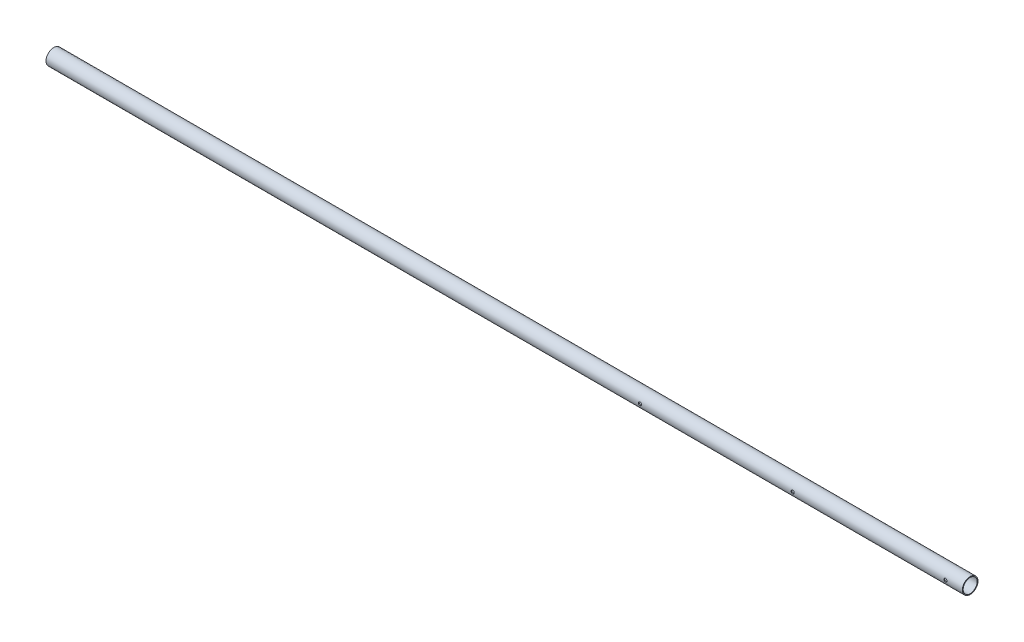
ISO-10303-21;
HEADER;
FILE_DESCRIPTION(('STEP AP214'),'2;1');
FILE_NAME('part.step','',(''),(''),'','','');
FILE_SCHEMA(('AUTOMOTIVE_DESIGN { 1 0 10303 214 1 1 1 1 }'));
ENDSEC;
DATA;
#1=APPLICATION_CONTEXT('core data for automotive mechanical design processes');
#2=APPLICATION_PROTOCOL_DEFINITION('international standard','automotive_design',2000,#1);
#3=PRODUCT_CONTEXT('',#1,'mechanical');
#4=PRODUCT('Part','Part','',(#3));
#5=PRODUCT_RELATED_PRODUCT_CATEGORY('part','',(#4));
#6=PRODUCT_DEFINITION_FORMATION('','',#4);
#7=PRODUCT_DEFINITION_CONTEXT('part definition',#1,'design');
#8=PRODUCT_DEFINITION('design','',#6,#7);
#9=PRODUCT_DEFINITION_SHAPE('','',#8);
#10=(LENGTH_UNIT() NAMED_UNIT(*) SI_UNIT(.MILLI.,.METRE.));
#11=(NAMED_UNIT(*) PLANE_ANGLE_UNIT() SI_UNIT($,.RADIAN.));
#12=(NAMED_UNIT(*) SI_UNIT($,.STERADIAN.) SOLID_ANGLE_UNIT());
#13=UNCERTAINTY_MEASURE_WITH_UNIT(LENGTH_MEASURE(1.E-05),#10,'distance_accuracy_value','');
#14=(GEOMETRIC_REPRESENTATION_CONTEXT(3) GLOBAL_UNCERTAINTY_ASSIGNED_CONTEXT((#13)) GLOBAL_UNIT_ASSIGNED_CONTEXT((#10,
#11,#12)) REPRESENTATION_CONTEXT('',''));
#15=CARTESIAN_POINT('',(0.,0.,0.));
#16=DIRECTION('',(0.,0.,1.));
#17=DIRECTION('',(1.,0.,0.));
#18=AXIS2_PLACEMENT_3D('',#15,#16,#17);
#19=CARTESIAN_POINT('',(1346.2,0.,0.));
#20=DIRECTION('',(0.,0.,1.));
#21=DIRECTION('',(1.,0.,0.));
#22=AXIS2_PLACEMENT_3D('',#19,#20,#21);
#23=CYLINDRICAL_SURFACE('',#22,2.3876);
#24=CARTESIAN_POINT('',(1348.5876,0.,10.4648));
#25=CARTESIAN_POINT('',(1348.58759342942,-0.132130476058958,10.4647964514016));
#26=CARTESIAN_POINT('',(1348.57658382838,-0.26442035829009,10.462269601893));
#27=CARTESIAN_POINT('',(1348.53285409384,-0.525345225066874,10.4524244369325));
#28=CARTESIAN_POINT('',(1348.5000921047,-0.653972663795576,10.4450968843992));
#29=CARTESIAN_POINT('',(1348.41394288479,-0.903596989816673,10.426465897886));
#30=CARTESIAN_POINT('',(1348.36058819743,-1.0246055682684,10.4151687397336));
#31=CARTESIAN_POINT('',(1348.2348585468,-1.25591227924269,10.3898161075362));
#32=CARTESIAN_POINT('',(1348.16248912613,-1.36621352003838,10.3757614375804));
#33=CARTESIAN_POINT('',(1347.99943793492,-1.57495019781505,10.3461524526149));
#34=CARTESIAN_POINT('',(1347.90848664261,-1.67317229092837,10.3305780670015));
#35=CARTESIAN_POINT('',(1347.71142734329,-1.85311314339548,10.2998234611443));
#36=CARTESIAN_POINT('',(1347.60531706909,-1.93482942970319,10.2846433002633));
#37=CARTESIAN_POINT('',(1347.37936947375,-2.08038327019831,10.2561995352339));
#38=CARTESIAN_POINT('',(1347.25938154656,-2.14399244864527,10.2429613530362));
#39=CARTESIAN_POINT('',(1347.01006778758,-2.25005969360349,10.2201875236951));
#40=CARTESIAN_POINT('',(1346.88074325748,-2.29252070204645,10.2106513616026));
#41=CARTESIAN_POINT('',(1346.6187332751,-2.3543805931442,10.1965646284168));
#42=CARTESIAN_POINT('',(1346.48614123018,-2.37415617862409,10.1919327227922));
#43=CARTESIAN_POINT('',(1346.21944657922,-2.39125577964706,10.187934919261));
#44=CARTESIAN_POINT('',(1346.08534417616,-2.38858277701799,10.1885683219677));
#45=CARTESIAN_POINT('',(1345.822261765,-2.36116353389813,10.19495607049));
#46=CARTESIAN_POINT('',(1345.6932329336,-2.33685826485837,10.2006081066181));
#47=CARTESIAN_POINT('',(1345.4411330728,-2.26756413482412,10.2162342190724));
#48=CARTESIAN_POINT('',(1345.31806244654,-2.22257387640582,10.2262085874015));
#49=CARTESIAN_POINT('',(1345.08014690702,-2.11278891738552,10.2494546633016));
#50=CARTESIAN_POINT('',(1344.96538204721,-2.04782683973289,10.262754053739));
#51=CARTESIAN_POINT('',(1344.74822847749,-1.9000645756493,10.2911338885937));
#52=CARTESIAN_POINT('',(1344.64584072971,-1.81726300387498,10.30621447129));
#53=CARTESIAN_POINT('',(1344.45382007371,-1.63386805841729,10.3368922317217));
#54=CARTESIAN_POINT('',(1344.36454200676,-1.53290344594706,10.352493236861));
#55=CARTESIAN_POINT('',(1344.20408669377,-1.31720690355541,10.3821402814243));
#56=CARTESIAN_POINT('',(1344.13291729276,-1.20246903835412,10.3961856454301));
#57=CARTESIAN_POINT('',(1344.01060276489,-0.961997129098335,10.4211927318742));
#58=CARTESIAN_POINT('',(1343.95952331596,-0.836228635777724,10.4321443077834));
#59=CARTESIAN_POINT('',(1343.87942240763,-0.577744190266569,10.4496381198318));
#60=CARTESIAN_POINT('',(1343.85035483603,-0.445043387745706,10.4561895704206));
#61=CARTESIAN_POINT('',(1343.82596205163,-0.259405998113417,10.4617127845025));
#62=CARTESIAN_POINT('',(1343.82088093484,-0.207669475492341,10.4628677610205));
#63=CARTESIAN_POINT('',(1343.81409861297,-0.103963530060327,10.4644120677081));
#64=CARTESIAN_POINT('',(1343.81239741444,-0.0519941067982687,10.464801396394));
#65=CARTESIAN_POINT('',(1343.81240657058,0.132130476058952,10.4647964514016));
#66=CARTESIAN_POINT('',(1343.82341617162,0.264420358290088,10.462269601893));
#67=CARTESIAN_POINT('',(1343.86714590616,0.52534522506687,10.4524244369325));
#68=CARTESIAN_POINT('',(1343.8999078953,0.653972663795564,10.4450968843992));
#69=CARTESIAN_POINT('',(1343.98605711521,0.903596989816605,10.426465897886));
#70=CARTESIAN_POINT('',(1344.03941180257,1.02460556826829,10.4151687397336));
#71=CARTESIAN_POINT('',(1344.1651414532,1.25591227924259,10.3898161075362));
#72=CARTESIAN_POINT('',(1344.23751087387,1.36621352003832,10.3757614375804));
#73=CARTESIAN_POINT('',(1344.40056206508,1.57495019781504,10.3461524526149));
#74=CARTESIAN_POINT('',(1344.49151335739,1.67317229092836,10.3305780670015));
#75=CARTESIAN_POINT('',(1344.68857265671,1.85311314339549,10.2998234611443));
#76=CARTESIAN_POINT('',(1344.79468293091,1.93482942970319,10.2846433002633));
#77=CARTESIAN_POINT('',(1345.02063052625,2.08038327019831,10.2561995352339));
#78=CARTESIAN_POINT('',(1345.14061845344,2.14399244864527,10.2429613530362));
#79=CARTESIAN_POINT('',(1345.38993221242,2.25005969360349,10.2201875236951));
#80=CARTESIAN_POINT('',(1345.51925674251,2.29252070204645,10.2106513616026));
#81=CARTESIAN_POINT('',(1345.7812667249,2.3543805931442,10.1965646284168));
#82=CARTESIAN_POINT('',(1345.91385876982,2.37415617862409,10.1919327227922));
#83=CARTESIAN_POINT('',(1346.18055342078,2.39125577964706,10.187934919261));
#84=CARTESIAN_POINT('',(1346.31465582384,2.38858277701799,10.1885683219677));
#85=CARTESIAN_POINT('',(1346.577738235,2.36116353389813,10.19495607049));
#86=CARTESIAN_POINT('',(1346.7067670664,2.33685826485837,10.2006081066181));
#87=CARTESIAN_POINT('',(1346.9588669272,2.26756413482412,10.2162342190724));
#88=CARTESIAN_POINT('',(1347.08193755346,2.22257387640582,10.2262085874015));
#89=CARTESIAN_POINT('',(1347.31985309298,2.11278891738551,10.2494546633016));
#90=CARTESIAN_POINT('',(1347.43461795279,2.04782683973289,10.262754053739));
#91=CARTESIAN_POINT('',(1347.65177152251,1.9000645756493,10.2911338885937));
#92=CARTESIAN_POINT('',(1347.75415927029,1.81726300387498,10.30621447129));
#93=CARTESIAN_POINT('',(1347.94617992629,1.63386805841729,10.3368922317217));
#94=CARTESIAN_POINT('',(1348.03545799324,1.53290344594706,10.352493236861));
#95=CARTESIAN_POINT('',(1348.19591330623,1.31720690355541,10.3821402814243));
#96=CARTESIAN_POINT('',(1348.26708270724,1.20246903835412,10.3961856454301));
#97=CARTESIAN_POINT('',(1348.38939723511,0.961997129098335,10.4211927318742));
#98=CARTESIAN_POINT('',(1348.44047668404,0.836228635777724,10.4321443077834));
#99=CARTESIAN_POINT('',(1348.52057759237,0.577744190266569,10.4496381198318));
#100=CARTESIAN_POINT('',(1348.54964516397,0.445043387745705,10.4561895704206));
#101=CARTESIAN_POINT('',(1348.57403794837,0.259405998113415,10.4617127845025));
#102=CARTESIAN_POINT('',(1348.57911906516,0.207669475492338,10.4628677610205));
#103=CARTESIAN_POINT('',(1348.58590138703,0.103963530060321,10.4644120677081));
#104=CARTESIAN_POINT('',(1348.58760258556,0.0519941067982618,10.464801396394));
#105=CARTESIAN_POINT('',(1348.5876,0.,10.4648));
#106=B_SPLINE_CURVE_WITH_KNOTS('',3,(#24,#25,#26,#27,#28,#29,#30,#31,#32,#33,#34,#35,#36,#37,
#38,#39,#40,#41,#42,#43,#44,#45,#46,#47,#48,#49,#50,#51,#52,#53,#54,#55,#56,#57,#58,#59,#60,#61,
#62,#63,#64,#65,#66,#67,#68,#69,#70,#71,#72,#73,#74,#75,#76,#77,#78,#79,#80,#81,#82,#83,#84,#85,
#86,#87,#88,#89,#90,#91,#92,#93,#94,#95,#96,#97,#98,#99,#100,#101,#102,#103,#104,#105),
.UNSPECIFIED.,.T.,.F.,(4,2,2,2,2,2,2,2,2,2,2,2,2,2,2,2,2,2,2,2,2,2,2,2,2,2,2,2,2,2,2,2,2,2,2,2,
2,2,2,2,4),(0.,0.396192335565521,0.79314923653144,1.18948136344175,1.58569809138059,
1.98813187019891,2.39062590055581,2.79799171002006,3.20530083479917,3.60574375712302,
4.00613348977787,4.39854363394342,4.79098029220883,5.18679987270531,5.58265020204459,
5.98777052529928,6.39306605720458,6.7996757791592,7.20543132878512,7.36133500297467,
7.51723897927499,7.91343131484052,8.31038821580644,8.7067203427165,9.10293707065561,
9.50537084947393,9.90786487983083,10.3152306892951,10.7225398140742,11.122982736398,
11.5233724690529,11.9157826132184,12.3082192714839,12.7040388519803,13.0998891813196,
13.5050095045743,13.9103050364796,14.3169147584342,14.7226703080601,14.8785739822497,
15.03447795855),.UNSPECIFIED.);
#107=CARTESIAN_POINT('',(1348.5876,0.,10.4648));
#108=VERTEX_POINT('',#107);
#109=EDGE_CURVE('E19',#108,#108,#106,.T.);
#110=ORIENTED_EDGE('',*,*,#109,.T.);
#111=EDGE_LOOP('',(#110));
#112=FACE_BOUND('',#111,.T.);
#113=CARTESIAN_POINT('',(1343.8124,0.,11.7094));
#114=CARTESIAN_POINT('',(1343.81240638749,0.132501086344402,11.7093968551788));
#115=CARTESIAN_POINT('',(1343.82347741642,0.265166024845111,11.7071257374413));
#116=CARTESIAN_POINT('',(1343.86746253428,0.526849554492236,11.6982775922243));
#117=CARTESIAN_POINT('',(1343.90041970649,0.655860429224841,11.6916920721091));
#118=CARTESIAN_POINT('',(1343.98711640493,0.906255046388023,11.6749505775353));
#119=CARTESIAN_POINT('',(1344.04082606826,1.02764945848302,11.6647997354875));
#120=CARTESIAN_POINT('',(1344.16742554739,1.25965911690133,11.6420321579165));
#121=CARTESIAN_POINT('',(1344.24030911711,1.3702778574534,11.6294162257641));
#122=CARTESIAN_POINT('',(1344.40428905761,1.57921276418643,11.6029039480084));
#123=CARTESIAN_POINT('',(1344.49560496124,1.6773548592244,11.5889933768196));
#124=CARTESIAN_POINT('',(1344.69338992463,1.85704483488596,11.5615619569379));
#125=CARTESIAN_POINT('',(1344.79986100551,1.93859049865887,11.5480411605155));
#126=CARTESIAN_POINT('',(1345.02617616915,2.08350496871513,11.5227833227264));
#127=CARTESIAN_POINT('',(1345.14613726705,2.14669446383451,11.5110643719314));
#128=CARTESIAN_POINT('',(1345.39525169725,2.2519530622886,11.4909375714077));
#129=CARTESIAN_POINT('',(1345.52440400429,2.29402451711494,11.4825293530518));
#130=CARTESIAN_POINT('',(1345.78637591486,2.35529135266296,11.4701187577407));
#131=CARTESIAN_POINT('',(1345.91912176044,2.37479005044551,11.466058019604));
#132=CARTESIAN_POINT('',(1346.18605820987,2.39130019113447,11.4626265766828));
#133=CARTESIAN_POINT('',(1346.32024866074,2.38831399216307,11.4632553800786));
#134=CARTESIAN_POINT('',(1346.58403749701,2.36018417024732,11.4690789755403));
#135=CARTESIAN_POINT('',(1346.71367490494,2.33538937330178,11.4742018815859));
#136=CARTESIAN_POINT('',(1346.96691147803,2.26489687388461,11.4883232389105));
#137=CARTESIAN_POINT('',(1347.09051029864,2.21919798021408,11.4973219110444));
#138=CARTESIAN_POINT('',(1347.32916405645,2.10786238672539,11.5182541614116));
#139=CARTESIAN_POINT('',(1347.44415275148,2.04208765068246,11.530207946514));
#140=CARTESIAN_POINT('',(1347.66158281708,1.89256990409025,11.5556895535593));
#141=CARTESIAN_POINT('',(1347.76402360739,1.80882606308652,11.5692174482375));
#142=CARTESIAN_POINT('',(1347.95545409263,1.62390008155478,11.5966321353516));
#143=CARTESIAN_POINT('',(1348.04415921704,1.52242344107398,11.6105209319932));
#144=CARTESIAN_POINT('',(1348.20337284237,1.30583257466412,11.6368694878022));
#145=CARTESIAN_POINT('',(1348.27387336649,1.19071240261345,11.6493286192029));
#146=CARTESIAN_POINT('',(1348.39472850654,0.949748586750855,11.6714479602392));
#147=CARTESIAN_POINT('',(1348.4450333982,0.823879389397865,11.6811012456));
#148=CARTESIAN_POINT('',(1348.52360409381,0.565396223279503,11.6964543805325));
#149=CARTESIAN_POINT('',(1348.55191613784,0.432797033549384,11.7021625219848));
#150=CARTESIAN_POINT('',(1348.57507485099,0.249318904557282,11.7068515544713));
#151=CARTESIAN_POINT('',(1348.57976771513,0.199582540492454,11.7078050643738));
#152=CARTESIAN_POINT('',(1348.58603149622,0.0999052173920099,11.7090798805314));
#153=CARTESIAN_POINT('',(1348.58760240863,0.0499642580588537,11.7094011858669));
#154=CARTESIAN_POINT('',(1348.58759361251,-0.132501086344418,11.7093968551788));
#155=CARTESIAN_POINT('',(1348.57652258358,-0.265166024845124,11.7071257374413));
#156=CARTESIAN_POINT('',(1348.53253746572,-0.526849554492242,11.6982775922243));
#157=CARTESIAN_POINT('',(1348.49958029351,-0.655860429224842,11.6916920721091));
#158=CARTESIAN_POINT('',(1348.41288359507,-0.906255046388021,11.6749505775353));
#159=CARTESIAN_POINT('',(1348.35917393174,-1.02764945848302,11.6647997354875));
#160=CARTESIAN_POINT('',(1348.23257445261,-1.25965911690133,11.6420321579165));
#161=CARTESIAN_POINT('',(1348.15969088289,-1.3702778574534,11.6294162257641));
#162=CARTESIAN_POINT('',(1347.99571094239,-1.57921276418643,11.6029039480084));
#163=CARTESIAN_POINT('',(1347.90439503876,-1.6773548592244,11.5889933768196));
#164=CARTESIAN_POINT('',(1347.70661007537,-1.85704483488596,11.5615619569379));
#165=CARTESIAN_POINT('',(1347.60013899449,-1.93859049865887,11.5480411605155));
#166=CARTESIAN_POINT('',(1347.37382383085,-2.08350496871509,11.5227833227264));
#167=CARTESIAN_POINT('',(1347.25386273295,-2.14669446383445,11.5110643719314));
#168=CARTESIAN_POINT('',(1347.00474830275,-2.25195306228856,11.4909375714077));
#169=CARTESIAN_POINT('',(1346.87559599571,-2.29402451711493,11.4825293530518));
#170=CARTESIAN_POINT('',(1346.61362408514,-2.35529135266296,11.4701187577407));
#171=CARTESIAN_POINT('',(1346.48087823956,-2.37479005044551,11.466058019604));
#172=CARTESIAN_POINT('',(1346.21394179013,-2.39130019113447,11.4626265766828));
#173=CARTESIAN_POINT('',(1346.07975133926,-2.38831399216307,11.4632553800786));
#174=CARTESIAN_POINT('',(1345.81596250299,-2.36018417024732,11.4690789755403));
#175=CARTESIAN_POINT('',(1345.68632509506,-2.33538937330178,11.4742018815859));
#176=CARTESIAN_POINT('',(1345.43308852197,-2.26489687388461,11.4883232389105));
#177=CARTESIAN_POINT('',(1345.30948970136,-2.21919798021407,11.4973219110444));
#178=CARTESIAN_POINT('',(1345.07083594354,-2.10786238672536,11.5182541614117));
#179=CARTESIAN_POINT('',(1344.95584724852,-2.04208765068242,11.530207946514));
#180=CARTESIAN_POINT('',(1344.73841718292,-1.89256990409018,11.5556895535593));
#181=CARTESIAN_POINT('',(1344.63597639261,-1.80882606308647,11.5692174482375));
#182=CARTESIAN_POINT('',(1344.44454590737,-1.6239000815548,11.5966321353516));
#183=CARTESIAN_POINT('',(1344.35584078296,-1.52242344107406,11.6105209319932));
#184=CARTESIAN_POINT('',(1344.19662715763,-1.30583257466421,11.6368694878022));
#185=CARTESIAN_POINT('',(1344.12612663351,-1.19071240261349,11.6493286192029));
#186=CARTESIAN_POINT('',(1344.00527149346,-0.949748586750846,11.6714479602392));
#187=CARTESIAN_POINT('',(1343.9549666018,-0.823879389397863,11.6811012456));
#188=CARTESIAN_POINT('',(1343.87639590619,-0.565396223279506,11.6964543805325));
#189=CARTESIAN_POINT('',(1343.84808386216,-0.432797033549385,11.7021625219848));
#190=CARTESIAN_POINT('',(1343.82492514901,-0.249318904557286,11.7068515544713));
#191=CARTESIAN_POINT('',(1343.82023228487,-0.199582540492461,11.7078050643738));
#192=CARTESIAN_POINT('',(1343.81396850378,-0.0999052173920233,11.7090798805314));
#193=CARTESIAN_POINT('',(1343.81239759137,-0.0499642580588701,11.7094011858669));
#194=CARTESIAN_POINT('',(1343.8124,0.,11.7094));
#195=B_SPLINE_CURVE_WITH_KNOTS('',3,(#113,#114,#115,#116,#117,#118,#119,#120,#121,#122,#123,
#124,#125,#126,#127,#128,#129,#130,#131,#132,#133,#134,#135,#136,#137,#138,#139,#140,#141,#142,
#143,#144,#145,#146,#147,#148,#149,#150,#151,#152,#153,#154,#155,#156,#157,#158,#159,#160,#161,
#162,#163,#164,#165,#166,#167,#168,#169,#170,#171,#172,#173,#174,#175,#176,#177,#178,#179,#180,
#181,#182,#183,#184,#185,#186,#187,#188,#189,#190,#191,#192,#193,#194),.UNSPECIFIED.,.T.,.F.,(4,
2,2,2,2,2,2,2,2,2,2,2,2,2,2,2,2,2,2,2,2,2,2,2,2,2,2,2,2,2,2,2,2,2,2,2,2,2,2,2,4),(0.,
0.397312200182848,0.795408844407309,1.19293474701021,1.59033131169665,1.99277446437493,
2.39527133774065,2.80157706515167,3.20783754041949,3.60857317253208,4.00926677774833,
4.40366556094125,4.79808682135193,5.19528356005151,5.5924986594244,5.99707755264027,
6.40183342228438,6.80757983006336,7.21247082756086,7.36229133822712,7.51211206685327,
7.90942426703611,8.30752091126056,8.70504681386346,9.1024433785499,9.50488653122819,
9.9073834045939,10.3136891320047,10.7199496072727,11.1206852393853,11.5213788446016,
11.9157776277945,12.3101988882052,12.707395626905,13.1046107262777,13.5091896194935,
13.9139454891377,14.3196918969166,14.7245828944141,14.8744034050804,15.0242241337065),.UNSPECIFIED.);
#196=CARTESIAN_POINT('',(1343.8124,0.,11.7094));
#197=VERTEX_POINT('',#196);
#198=EDGE_CURVE('E58',#197,#197,#195,.T.);
#199=ORIENTED_EDGE('',*,*,#198,.F.);
#200=EDGE_LOOP('',(#199));
#201=FACE_BOUND('',#200,.T.);
#202=ADVANCED_FACE('F15',(#112,#201),#23,.F.);
#203=CARTESIAN_POINT('',(1117.6,0.,0.));
#204=DIRECTION('',(0.,0.,1.));
#205=DIRECTION('',(1.,0.,0.));
#206=AXIS2_PLACEMENT_3D('',#203,#204,#205);
#207=CYLINDRICAL_SURFACE('',#206,2.3876);
#208=CARTESIAN_POINT('',(1119.9876,0.,10.4648));
#209=CARTESIAN_POINT('',(1119.98759342942,-0.132130476058946,10.4647964514016));
#210=CARTESIAN_POINT('',(1119.97658382838,-0.26442035829007,10.462269601893));
#211=CARTESIAN_POINT('',(1119.93285409384,-0.525345225066845,10.4524244369325));
#212=CARTESIAN_POINT('',(1119.9000921047,-0.653972663795546,10.4450968843992));
#213=CARTESIAN_POINT('',(1119.81394288479,-0.903596989816637,10.426465897886));
#214=CARTESIAN_POINT('',(1119.76058819743,-1.02460556826837,10.4151687397336));
#215=CARTESIAN_POINT('',(1119.6348585468,-1.25591227924265,10.3898161075362));
#216=CARTESIAN_POINT('',(1119.56248912613,-1.36621352003833,10.3757614375804));
#217=CARTESIAN_POINT('',(1119.39943793492,-1.57495019781507,10.3461524526149));
#218=CARTESIAN_POINT('',(1119.30848664261,-1.67317229092845,10.3305780670014));
#219=CARTESIAN_POINT('',(1119.11142734329,-1.85311314339558,10.2998234611443));
#220=CARTESIAN_POINT('',(1119.00531706909,-1.93482942970322,10.2846433002633));
#221=CARTESIAN_POINT('',(1118.77936947375,-2.08038327019833,10.2561995352339));
#222=CARTESIAN_POINT('',(1118.65938154656,-2.14399244864533,10.2429613530362));
#223=CARTESIAN_POINT('',(1118.41006778758,-2.25005969360353,10.2201875236951));
#224=CARTESIAN_POINT('',(1118.28074325748,-2.29252070204646,10.2106513616026));
#225=CARTESIAN_POINT('',(1118.0187332751,-2.35438059314421,10.1965646284168));
#226=CARTESIAN_POINT('',(1117.88614123018,-2.37415617862409,10.1919327227922));
#227=CARTESIAN_POINT('',(1117.61944657922,-2.39125577964706,10.187934919261));
#228=CARTESIAN_POINT('',(1117.48534417616,-2.38858277701799,10.1885683219677));
#229=CARTESIAN_POINT('',(1117.222261765,-2.36116353389813,10.19495607049));
#230=CARTESIAN_POINT('',(1117.0932329336,-2.33685826485838,10.2006081066181));
#231=CARTESIAN_POINT('',(1116.8411330728,-2.26756413482412,10.2162342190724));
#232=CARTESIAN_POINT('',(1116.71806244654,-2.2225738764058,10.2262085874015));
#233=CARTESIAN_POINT('',(1116.48014690702,-2.11278891738554,10.2494546633016));
#234=CARTESIAN_POINT('',(1116.36538204721,-2.04782683973298,10.262754053739));
#235=CARTESIAN_POINT('',(1116.14822847749,-1.90006457564939,10.2911338885937));
#236=CARTESIAN_POINT('',(1116.04584072971,-1.817263003875,10.30621447129));
#237=CARTESIAN_POINT('',(1115.85382007371,-1.6338680584173,10.3368922317217));
#238=CARTESIAN_POINT('',(1115.76454200676,-1.53290344594714,10.352493236861));
#239=CARTESIAN_POINT('',(1115.60408669377,-1.3172069035555,10.3821402814243));
#240=CARTESIAN_POINT('',(1115.53291729276,-1.20246903835416,10.3961856454301));
#241=CARTESIAN_POINT('',(1115.41060276489,-0.961997129098325,10.4211927318742));
#242=CARTESIAN_POINT('',(1115.35952331596,-0.836228635777721,10.4321443077834));
#243=CARTESIAN_POINT('',(1115.27942240763,-0.577744190266572,10.4496381198318));
#244=CARTESIAN_POINT('',(1115.25035483603,-0.445043387745706,10.4561895704206));
#245=CARTESIAN_POINT('',(1115.22596205163,-0.259405998113417,10.4617127845025));
#246=CARTESIAN_POINT('',(1115.22088093484,-0.207669475492341,10.4628677610205));
#247=CARTESIAN_POINT('',(1115.21409861297,-0.103963530060327,10.4644120677081));
#248=CARTESIAN_POINT('',(1115.21239741444,-0.0519941067982687,10.464801396394));
#249=CARTESIAN_POINT('',(1115.21240657058,0.13213047605894,10.4647964514016));
#250=CARTESIAN_POINT('',(1115.22341617162,0.264420358290064,10.462269601893));
#251=CARTESIAN_POINT('',(1115.26714590616,0.525345225066845,10.4524244369325));
#252=CARTESIAN_POINT('',(1115.2999078953,0.653972663795551,10.4450968843992));
#253=CARTESIAN_POINT('',(1115.38605711521,0.903596989816606,10.426465897886));
#254=CARTESIAN_POINT('',(1115.43941180257,1.0246055682683,10.4151687397336));
#255=CARTESIAN_POINT('',(1115.5651414532,1.25591227924258,10.3898161075362));
#256=CARTESIAN_POINT('',(1115.63751087387,1.36621352003831,10.3757614375804));
#257=CARTESIAN_POINT('',(1115.80056206508,1.57495019781508,10.3461524526149));
#258=CARTESIAN_POINT('',(1115.89151335739,1.67317229092846,10.3305780670014));
#259=CARTESIAN_POINT('',(1116.08857265671,1.85311314339557,10.2998234611443));
#260=CARTESIAN_POINT('',(1116.19468293091,1.93482942970322,10.2846433002633));
#261=CARTESIAN_POINT('',(1116.42063052625,2.08038327019829,10.2561995352339));
#262=CARTESIAN_POINT('',(1116.54061845344,2.14399244864527,10.2429613530362));
#263=CARTESIAN_POINT('',(1116.78993221242,2.25005969360349,10.2201875236951));
#264=CARTESIAN_POINT('',(1116.91925674251,2.29252070204645,10.2106513616026));
#265=CARTESIAN_POINT('',(1117.1812667249,2.3543805931442,10.1965646284168));
#266=CARTESIAN_POINT('',(1117.31385876982,2.37415617862409,10.1919327227922));
#267=CARTESIAN_POINT('',(1117.58055342078,2.39125577964706,10.187934919261));
#268=CARTESIAN_POINT('',(1117.71465582384,2.38858277701799,10.1885683219677));
#269=CARTESIAN_POINT('',(1117.977738235,2.36116353389813,10.19495607049));
#270=CARTESIAN_POINT('',(1118.1067670664,2.33685826485838,10.2006081066181));
#271=CARTESIAN_POINT('',(1118.3588669272,2.26756413482412,10.2162342190724));
#272=CARTESIAN_POINT('',(1118.48193755346,2.2225738764058,10.2262085874015));
#273=CARTESIAN_POINT('',(1118.71985309298,2.11278891738554,10.2494546633016));
#274=CARTESIAN_POINT('',(1118.83461795279,2.04782683973298,10.262754053739));
#275=CARTESIAN_POINT('',(1119.05177152251,1.9000645756494,10.2911338885937));
#276=CARTESIAN_POINT('',(1119.15415927029,1.81726300387501,10.30621447129));
#277=CARTESIAN_POINT('',(1119.34617992629,1.63386805841727,10.3368922317217));
#278=CARTESIAN_POINT('',(1119.43545799324,1.53290344594706,10.352493236861));
#279=CARTESIAN_POINT('',(1119.59591330623,1.31720690355542,10.3821402814243));
#280=CARTESIAN_POINT('',(1119.66708270724,1.20246903835412,10.3961856454301));
#281=CARTESIAN_POINT('',(1119.78939723511,0.961997129098315,10.4211927318742));
#282=CARTESIAN_POINT('',(1119.84047668404,0.836228635777681,10.4321443077834));
#283=CARTESIAN_POINT('',(1119.92057759237,0.577744190266524,10.4496381198318));
#284=CARTESIAN_POINT('',(1119.94964516397,0.445043387745684,10.4561895704206));
#285=CARTESIAN_POINT('',(1119.97403794837,0.259405998113416,10.4617127845025));
#286=CARTESIAN_POINT('',(1119.97911906516,0.207669475492338,10.4628677610205));
#287=CARTESIAN_POINT('',(1119.98590138703,0.103963530060321,10.4644120677081));
#288=CARTESIAN_POINT('',(1119.98760258556,0.0519941067982621,10.464801396394));
#289=CARTESIAN_POINT('',(1119.9876,0.,10.4648));
#290=B_SPLINE_CURVE_WITH_KNOTS('',3,(#208,#209,#210,#211,#212,#213,#214,#215,#216,#217,#218,
#219,#220,#221,#222,#223,#224,#225,#226,#227,#228,#229,#230,#231,#232,#233,#234,#235,#236,#237,
#238,#239,#240,#241,#242,#243,#244,#245,#246,#247,#248,#249,#250,#251,#252,#253,#254,#255,#256,
#257,#258,#259,#260,#261,#262,#263,#264,#265,#266,#267,#268,#269,#270,#271,#272,#273,#274,#275,
#276,#277,#278,#279,#280,#281,#282,#283,#284,#285,#286,#287,#288,#289),.UNSPECIFIED.,.T.,.F.,(4,
2,2,2,2,2,2,2,2,2,2,2,2,2,2,2,2,2,2,2,2,2,2,2,2,2,2,2,2,2,2,2,2,2,2,2,2,2,2,2,4),(0.,
0.396192335565485,0.793149236531439,1.18948136344158,1.58569809138061,1.98813187019902,
2.39062590055585,2.79799171002033,3.20530083479921,3.60574375712305,4.0061334897779,
4.39854363394346,4.79098029220887,5.1867998727053,5.58265020204464,5.98777052529925,
6.39306605720464,6.79967577915926,7.20543132878518,7.36133500297473,7.51723897927505,
7.91343131484054,8.3103882158065,8.70672034271655,9.10293707065567,9.50537084947407,
9.9078648798309,10.3152306892951,10.7225398140743,11.1229827363981,11.523372469053,
11.9157826132185,12.3082192714839,12.7040388519804,13.0998891813197,13.5050095045744,
13.9103050364797,14.3169147584344,14.7226703080602,14.8785739822498,15.0344779585501),.UNSPECIFIED.);
#291=CARTESIAN_POINT('',(1119.9876,0.,10.4648));
#292=VERTEX_POINT('',#291);
#293=EDGE_CURVE('E70',#292,#292,#290,.T.);
#294=ORIENTED_EDGE('',*,*,#293,.T.);
#295=EDGE_LOOP('',(#294));
#296=FACE_BOUND('',#295,.T.);
#297=CARTESIAN_POINT('',(1115.2124,0.,11.7094));
#298=CARTESIAN_POINT('',(1115.21240638749,0.132501086344402,11.7093968551788));
#299=CARTESIAN_POINT('',(1115.22347741642,0.265166024845111,11.7071257374413));
#300=CARTESIAN_POINT('',(1115.26746253428,0.526849554492236,11.6982775922243));
#301=CARTESIAN_POINT('',(1115.30041970649,0.655860429224841,11.6916920721091));
#302=CARTESIAN_POINT('',(1115.38711640493,0.906255046388022,11.6749505775353));
#303=CARTESIAN_POINT('',(1115.44082606826,1.02764945848302,11.6647997354875));
#304=CARTESIAN_POINT('',(1115.56742554739,1.25965911690133,11.6420321579165));
#305=CARTESIAN_POINT('',(1115.64030911711,1.3702778574534,11.6294162257641));
#306=CARTESIAN_POINT('',(1115.80428905761,1.57921276418635,11.6029039480085));
#307=CARTESIAN_POINT('',(1115.89560496124,1.67735485922423,11.5889933768197));
#308=CARTESIAN_POINT('',(1116.09338992463,1.85704483488583,11.5615619569379));
#309=CARTESIAN_POINT('',(1116.19986100551,1.93859049865881,11.5480411605156));
#310=CARTESIAN_POINT('',(1116.42617616915,2.08350496871514,11.5227833227264));
#311=CARTESIAN_POINT('',(1116.54613726705,2.14669446383451,11.5110643719314));
#312=CARTESIAN_POINT('',(1116.79525169725,2.2519530622886,11.4909375714077));
#313=CARTESIAN_POINT('',(1116.92440400429,2.29402451711494,11.4825293530518));
#314=CARTESIAN_POINT('',(1117.18637591486,2.35529135266296,11.4701187577407));
#315=CARTESIAN_POINT('',(1117.31912176044,2.37479005044551,11.466058019604));
#316=CARTESIAN_POINT('',(1117.58605820987,2.39130019113447,11.4626265766828));
#317=CARTESIAN_POINT('',(1117.72024866074,2.38831399216308,11.4632553800786));
#318=CARTESIAN_POINT('',(1117.98403749701,2.36018417024732,11.4690789755403));
#319=CARTESIAN_POINT('',(1118.11367490494,2.3353893733018,11.4742018815859));
#320=CARTESIAN_POINT('',(1118.36691147803,2.26489687388466,11.4883232389105));
#321=CARTESIAN_POINT('',(1118.49051029864,2.21919798021411,11.4973219110444));
#322=CARTESIAN_POINT('',(1118.72916405645,2.10786238672539,11.5182541614116));
#323=CARTESIAN_POINT('',(1118.84415275148,2.04208765068247,11.530207946514));
#324=CARTESIAN_POINT('',(1119.06158281708,1.89256990409024,11.5556895535593));
#325=CARTESIAN_POINT('',(1119.16402360739,1.80882606308651,11.5692174482375));
#326=CARTESIAN_POINT('',(1119.35545409263,1.62390008155481,11.5966321353515));
#327=CARTESIAN_POINT('',(1119.44415921704,1.52242344107405,11.6105209319932));
#328=CARTESIAN_POINT('',(1119.60337284237,1.30583257466421,11.6368694878022));
#329=CARTESIAN_POINT('',(1119.67387336649,1.19071240261351,11.6493286192029));
#330=CARTESIAN_POINT('',(1119.79472850654,0.94974858675087,11.6714479602392));
#331=CARTESIAN_POINT('',(1119.8450333982,0.823879389397882,11.6811012456));
#332=CARTESIAN_POINT('',(1119.92360409381,0.56539622327953,11.6964543805325));
#333=CARTESIAN_POINT('',(1119.95191613784,0.432797033549413,11.7021625219848));
#334=CARTESIAN_POINT('',(1119.97507485099,0.249318904557284,11.7068515544713));
#335=CARTESIAN_POINT('',(1119.97976771513,0.199582540492454,11.7078050643738));
#336=CARTESIAN_POINT('',(1119.98603149622,0.0999052173920093,11.7090798805314));
#337=CARTESIAN_POINT('',(1119.98760240863,0.0499642580588534,11.7094011858669));
#338=CARTESIAN_POINT('',(1119.98759361251,-0.132501086344418,11.7093968551788));
#339=CARTESIAN_POINT('',(1119.97652258358,-0.265166024845123,11.7071257374413));
#340=CARTESIAN_POINT('',(1119.93253746572,-0.526849554492242,11.6982775922243));
#341=CARTESIAN_POINT('',(1119.89958029351,-0.655860429224843,11.6916920721091));
#342=CARTESIAN_POINT('',(1119.81288359507,-0.90625504638802,11.6749505775353));
#343=CARTESIAN_POINT('',(1119.75917393174,-1.02764945848302,11.6647997354875));
#344=CARTESIAN_POINT('',(1119.63257445261,-1.25965911690134,11.6420321579165));
#345=CARTESIAN_POINT('',(1119.55969088289,-1.37027785745341,11.6294162257641));
#346=CARTESIAN_POINT('',(1119.39571094239,-1.57921276418639,11.6029039480084));
#347=CARTESIAN_POINT('',(1119.30439503876,-1.6773548592243,11.5889933768196));
#348=CARTESIAN_POINT('',(1119.10661007537,-1.85704483488587,11.5615619569379));
#349=CARTESIAN_POINT('',(1119.00013899449,-1.93859049865884,11.5480411605155));
#350=CARTESIAN_POINT('',(1118.77382383085,-2.08350496871515,11.5227833227264));
#351=CARTESIAN_POINT('',(1118.65386273295,-2.14669446383452,11.5110643719314));
#352=CARTESIAN_POINT('',(1118.40474830275,-2.25195306228859,11.4909375714077));
#353=CARTESIAN_POINT('',(1118.27559599571,-2.29402451711494,11.4825293530518));
#354=CARTESIAN_POINT('',(1118.01362408514,-2.35529135266295,11.4701187577407));
#355=CARTESIAN_POINT('',(1117.88087823956,-2.37479005044549,11.4660580196041));
#356=CARTESIAN_POINT('',(1117.61394179013,-2.39130019113447,11.4626265766828));
#357=CARTESIAN_POINT('',(1117.47975133926,-2.38831399216308,11.4632553800786));
#358=CARTESIAN_POINT('',(1117.21596250299,-2.36018417024732,11.4690789755403));
#359=CARTESIAN_POINT('',(1117.08632509506,-2.33538937330178,11.4742018815859));
#360=CARTESIAN_POINT('',(1116.83308852197,-2.26489687388461,11.4883232389105));
#361=CARTESIAN_POINT('',(1116.70948970136,-2.21919798021407,11.4973219110444));
#362=CARTESIAN_POINT('',(1116.47083594354,-2.10786238672539,11.5182541614116));
#363=CARTESIAN_POINT('',(1116.35584724852,-2.04208765068247,11.530207946514));
#364=CARTESIAN_POINT('',(1116.13841718292,-1.89256990409024,11.5556895535593));
#365=CARTESIAN_POINT('',(1116.03597639261,-1.80882606308651,11.5692174482375));
#366=CARTESIAN_POINT('',(1115.84454590737,-1.62390008155481,11.5966321353515));
#367=CARTESIAN_POINT('',(1115.75584078296,-1.52242344107405,11.6105209319932));
#368=CARTESIAN_POINT('',(1115.59662715763,-1.30583257466421,11.6368694878022));
#369=CARTESIAN_POINT('',(1115.52612663351,-1.19071240261351,11.6493286192029));
#370=CARTESIAN_POINT('',(1115.40527149346,-0.94974858675087,11.6714479602392));
#371=CARTESIAN_POINT('',(1115.3549666018,-0.823879389397883,11.6811012456));
#372=CARTESIAN_POINT('',(1115.27639590619,-0.565396223279531,11.6964543805325));
#373=CARTESIAN_POINT('',(1115.24808386216,-0.432797033549414,11.7021625219848));
#374=CARTESIAN_POINT('',(1115.22492514901,-0.249318904557289,11.7068515544713));
#375=CARTESIAN_POINT('',(1115.22023228487,-0.199582540492462,11.7078050643738));
#376=CARTESIAN_POINT('',(1115.21396850378,-0.0999052173920226,11.7090798805314));
#377=CARTESIAN_POINT('',(1115.21239759137,-0.0499642580588698,11.7094011858669));
#378=CARTESIAN_POINT('',(1115.2124,0.,11.7094));
#379=B_SPLINE_CURVE_WITH_KNOTS('',3,(#297,#298,#299,#300,#301,#302,#303,#304,#305,#306,#307,
#308,#309,#310,#311,#312,#313,#314,#315,#316,#317,#318,#319,#320,#321,#322,#323,#324,#325,#326,
#327,#328,#329,#330,#331,#332,#333,#334,#335,#336,#337,#338,#339,#340,#341,#342,#343,#344,#345,
#346,#347,#348,#349,#350,#351,#352,#353,#354,#355,#356,#357,#358,#359,#360,#361,#362,#363,#364,
#365,#366,#367,#368,#369,#370,#371,#372,#373,#374,#375,#376,#377,#378),.UNSPECIFIED.,.T.,.F.,(4,
2,2,2,2,2,2,2,2,2,2,2,2,2,2,2,2,2,2,2,2,2,2,2,2,2,2,2,2,2,2,2,2,2,2,2,2,2,2,2,4),(0.,
0.397312200182848,0.795408844407309,1.19293474701021,1.59033131169665,1.99277446437462,
2.39527133774065,2.80157706515167,3.20783754041949,3.60857317253208,4.00926677774833,
4.40366556094102,4.79808682135193,5.19528356005151,5.5924986594244,5.99707755264019,
6.40183342228439,6.80757983006323,7.21247082756084,7.3622913382271,7.51211206685325,
7.90942426703609,8.30752091126054,8.70504681386344,9.10244337854988,9.50488653122808,
9.90738340459387,10.3136891320049,10.7199496072727,11.1206852393851,11.5213788446015,
11.9157776277945,12.3101988882051,12.7073956269047,13.1046107262776,13.5091896194934,
13.9139454891376,14.3196918969164,14.7245828944141,14.8744034050803,15.0242241337065),.UNSPECIFIED.);
#380=CARTESIAN_POINT('',(1115.2124,0.,11.7094));
#381=VERTEX_POINT('',#380);
#382=EDGE_CURVE('E43',#381,#381,#379,.T.);
#383=ORIENTED_EDGE('',*,*,#382,.F.);
#384=EDGE_LOOP('',(#383));
#385=FACE_BOUND('',#384,.T.);
#386=ADVANCED_FACE('F99',(#296,#385),#207,.F.);
#387=CARTESIAN_POINT('',(889.,0.,0.));
#388=DIRECTION('',(0.,0.,1.));
#389=DIRECTION('',(1.,0.,0.));
#390=AXIS2_PLACEMENT_3D('',#387,#388,#389);
#391=CYLINDRICAL_SURFACE('',#390,2.3876);
#392=CARTESIAN_POINT('',(891.3876,0.,10.4648));
#393=CARTESIAN_POINT('',(891.387593429416,-0.13213047605894,10.4647964514016));
#394=CARTESIAN_POINT('',(891.376583828384,-0.264420358290048,10.462269601893));
#395=CARTESIAN_POINT('',(891.332854093839,-0.525345225066824,10.4524244369325));
#396=CARTESIAN_POINT('',(891.300092104702,-0.653972663795542,10.4450968843992));
#397=CARTESIAN_POINT('',(891.213942884793,-0.903596989816564,10.426465897886));
#398=CARTESIAN_POINT('',(891.160588197433,-1.02460556826821,10.4151687397336));
#399=CARTESIAN_POINT('',(891.034858546798,-1.25591227924248,10.3898161075362));
#400=CARTESIAN_POINT('',(890.962489126131,-1.36621352003824,10.3757614375804));
#401=CARTESIAN_POINT('',(890.799437934918,-1.57495019781497,10.3461524526149));
#402=CARTESIAN_POINT('',(890.708486642609,-1.67317229092829,10.3305780670015));
#403=CARTESIAN_POINT('',(890.511427343292,-1.85311314339543,10.2998234611443));
#404=CARTESIAN_POINT('',(890.40531706909,-1.93482942970316,10.2846433002633));
#405=CARTESIAN_POINT('',(890.179369473754,-2.08038327019829,10.2561995352339));
#406=CARTESIAN_POINT('',(890.059381546562,-2.14399244864526,10.2429613530362));
#407=CARTESIAN_POINT('',(889.810067787584,-2.25005969360345,10.2201875236951));
#408=CARTESIAN_POINT('',(889.680743257485,-2.29252070204642,10.2106513616026));
#409=CARTESIAN_POINT('',(889.418733275096,-2.35438059314418,10.1965646284168));
#410=CARTESIAN_POINT('',(889.286141230178,-2.37415617862407,10.1919327227922));
#411=CARTESIAN_POINT('',(889.01944657922,-2.39125577964706,10.187934919261));
#412=CARTESIAN_POINT('',(888.885344176163,-2.38858277701801,10.1885683219677));
#413=CARTESIAN_POINT('',(888.622261765005,-2.36116353389816,10.19495607049));
#414=CARTESIAN_POINT('',(888.493232933605,-2.33685826485841,10.2006081066181));
#415=CARTESIAN_POINT('',(888.241133072803,-2.26756413482416,10.2162342190724));
#416=CARTESIAN_POINT('',(888.118062446544,-2.22257387640585,10.2262085874015));
#417=CARTESIAN_POINT('',(887.88014690702,-2.1127889173856,10.2494546633016));
#418=CARTESIAN_POINT('',(887.765382047208,-2.04782683973303,10.262754053739));
#419=CARTESIAN_POINT('',(887.548228477491,-1.90006457564948,10.2911338885936));
#420=CARTESIAN_POINT('',(887.445840729707,-1.81726300387512,10.30621447129));
#421=CARTESIAN_POINT('',(887.253820073711,-1.6338680584174,10.3368922317217));
#422=CARTESIAN_POINT('',(887.164542006761,-1.53290344594718,10.352493236861));
#423=CARTESIAN_POINT('',(887.004086693767,-1.31720690355552,10.3821402814243));
#424=CARTESIAN_POINT('',(886.932917292764,-1.20246903835422,10.3961856454301));
#425=CARTESIAN_POINT('',(886.81060276489,-0.961997129098421,10.4211927318742));
#426=CARTESIAN_POINT('',(886.759523315965,-0.836228635777814,10.4321443077834));
#427=CARTESIAN_POINT('',(886.679422407632,-0.577744190266681,10.4496381198318));
#428=CARTESIAN_POINT('',(886.650354836026,-0.445043387745835,10.4561895704206));
#429=CARTESIAN_POINT('',(886.625962051625,-0.25940599811355,10.4617127845025));
#430=CARTESIAN_POINT('',(886.620880934836,-0.207669475492444,10.4628677610205));
#431=CARTESIAN_POINT('',(886.614098612967,-0.103963530060372,10.4644120677081));
#432=CARTESIAN_POINT('',(886.612397414437,-0.0519941067982864,10.464801396394));
#433=CARTESIAN_POINT('',(886.612406570584,0.132130476058941,10.4647964514016));
#434=CARTESIAN_POINT('',(886.623416171616,0.264420358290048,10.462269601893));
#435=CARTESIAN_POINT('',(886.667145906161,0.525345225066825,10.4524244369325));
#436=CARTESIAN_POINT('',(886.699907895298,0.653972663795544,10.4450968843992));
#437=CARTESIAN_POINT('',(886.786057115207,0.903596989816565,10.426465897886));
#438=CARTESIAN_POINT('',(886.839411802567,1.02460556826821,10.4151687397336));
#439=CARTESIAN_POINT('',(886.965141453202,1.25591227924248,10.3898161075362));
#440=CARTESIAN_POINT('',(887.037510873869,1.36621352003824,10.3757614375804));
#441=CARTESIAN_POINT('',(887.200562065082,1.574950197815,10.3461524526149));
#442=CARTESIAN_POINT('',(887.291513357391,1.67317229092832,10.3305780670015));
#443=CARTESIAN_POINT('',(887.488572656709,1.85311314339545,10.2998234611443));
#444=CARTESIAN_POINT('',(887.59468293091,1.93482942970317,10.2846433002633));
#445=CARTESIAN_POINT('',(887.820630526246,2.0803832701983,10.2561995352339));
#446=CARTESIAN_POINT('',(887.940618453438,2.14399244864526,10.2429613530362));
#447=CARTESIAN_POINT('',(888.189932212416,2.25005969360345,10.2201875236951));
#448=CARTESIAN_POINT('',(888.319256742515,2.29252070204642,10.2106513616026));
#449=CARTESIAN_POINT('',(888.581266724905,2.35438059314418,10.1965646284168));
#450=CARTESIAN_POINT('',(888.713858769822,2.37415617862407,10.1919327227922));
#451=CARTESIAN_POINT('',(888.98055342078,2.39125577964706,10.187934919261));
#452=CARTESIAN_POINT('',(889.114655823837,2.38858277701801,10.1885683219677));
#453=CARTESIAN_POINT('',(889.377738234995,2.36116353389816,10.19495607049));
#454=CARTESIAN_POINT('',(889.506767066396,2.33685826485841,10.2006081066181));
#455=CARTESIAN_POINT('',(889.758866927197,2.26756413482416,10.2162342190724));
#456=CARTESIAN_POINT('',(889.881937553456,2.22257387640585,10.2262085874015));
#457=CARTESIAN_POINT('',(890.11985309298,2.11278891738559,10.2494546633016));
#458=CARTESIAN_POINT('',(890.234617952792,2.04782683973301,10.262754053739));
#459=CARTESIAN_POINT('',(890.451771522509,1.90006457564944,10.2911338885936));
#460=CARTESIAN_POINT('',(890.554159270293,1.8172630038751,10.30621447129));
#461=CARTESIAN_POINT('',(890.746179926289,1.6338680584174,10.3368922317217));
#462=CARTESIAN_POINT('',(890.835457993239,1.53290344594718,10.352493236861));
#463=CARTESIAN_POINT('',(890.995913306233,1.31720690355552,10.3821402814243));
#464=CARTESIAN_POINT('',(891.067082707236,1.20246903835422,10.3961856454301));
#465=CARTESIAN_POINT('',(891.18939723511,0.961997129098421,10.4211927318742));
#466=CARTESIAN_POINT('',(891.240476684035,0.836228635777814,10.4321443077834));
#467=CARTESIAN_POINT('',(891.320577592368,0.577744190266681,10.4496381198318));
#468=CARTESIAN_POINT('',(891.349645163974,0.445043387745835,10.4561895704206));
#469=CARTESIAN_POINT('',(891.374037948375,0.259405998113552,10.4617127845025));
#470=CARTESIAN_POINT('',(891.379119065164,0.207669475492449,10.4628677610205));
#471=CARTESIAN_POINT('',(891.385901387033,0.103963530060378,10.4644120677081));
#472=CARTESIAN_POINT('',(891.387602585563,0.0519941067982894,10.464801396394));
#473=CARTESIAN_POINT('',(891.3876,0.,10.4648));
#474=B_SPLINE_CURVE_WITH_KNOTS('',3,(#392,#393,#394,#395,#396,#397,#398,#399,#400,#401,#402,
#403,#404,#405,#406,#407,#408,#409,#410,#411,#412,#413,#414,#415,#416,#417,#418,#419,#420,#421,
#422,#423,#424,#425,#426,#427,#428,#429,#430,#431,#432,#433,#434,#435,#436,#437,#438,#439,#440,
#441,#442,#443,#444,#445,#446,#447,#448,#449,#450,#451,#452,#453,#454,#455,#456,#457,#458,#459,
#460,#461,#462,#463,#464,#465,#466,#467,#468,#469,#470,#471,#472,#473),.UNSPECIFIED.,.T.,.F.,(4,
2,2,2,2,2,2,2,2,2,2,2,2,2,2,2,2,2,2,2,2,2,2,2,2,2,2,2,2,2,2,2,2,2,2,2,2,2,2,2,4),(0.,
0.396192335565467,0.793149236531383,1.18948136344143,1.58569809138048,1.98813187019881,
2.39062590055584,2.79799171002018,3.20530083479908,3.60574375712271,4.00613348977767,
4.39854363394333,4.79098029220874,5.18679987270505,5.58265020204436,5.98777052529913,
6.39306605720461,6.79967577915915,7.20543132878498,7.36133500297463,7.51723897927503,
7.9134313148405,8.31038821580642,8.70672034271646,9.10293707065552,9.50537084947396,
9.90786487983086,10.3152306892952,10.7225398140741,11.1229827363977,11.5233724690527,
11.9157826132184,12.3082192714838,12.7040388519802,13.0998891813194,13.5050095045742,
13.9103050364796,14.3169147584342,14.72267030806,14.8785739822497,15.0344779585501),.UNSPECIFIED.);
#475=CARTESIAN_POINT('',(891.3876,0.,10.4648));
#476=VERTEX_POINT('',#475);
#477=EDGE_CURVE('E66',#476,#476,#474,.T.);
#478=ORIENTED_EDGE('',*,*,#477,.T.);
#479=EDGE_LOOP('',(#478));
#480=FACE_BOUND('',#479,.T.);
#481=CARTESIAN_POINT('',(886.6124,0.,11.7094));
#482=CARTESIAN_POINT('',(886.612406387495,0.132501086344393,11.7093968551788));
#483=CARTESIAN_POINT('',(886.623477416424,0.265166024845092,11.7071257374413));
#484=CARTESIAN_POINT('',(886.667462534282,0.526849554492206,11.6982775922243));
#485=CARTESIAN_POINT('',(886.700419706489,0.655860429224807,11.6916920721091));
#486=CARTESIAN_POINT('',(886.78711640493,0.906255046388005,11.6749505775353));
#487=CARTESIAN_POINT('',(886.840826068261,1.02764945848302,11.6647997354875));
#488=CARTESIAN_POINT('',(886.967425547394,1.25965911690135,11.6420321579165));
#489=CARTESIAN_POINT('',(887.040309117112,1.37027785745342,11.6294162257641));
#490=CARTESIAN_POINT('',(887.204289057614,1.57921276418641,11.6029039480084));
#491=CARTESIAN_POINT('',(887.295604961238,1.67735485922434,11.5889933768196));
#492=CARTESIAN_POINT('',(887.49338992463,1.85704483488587,11.5615619569379));
#493=CARTESIAN_POINT('',(887.599861005511,1.93859049865876,11.5480411605156));
#494=CARTESIAN_POINT('',(887.826176169148,2.08350496871504,11.5227833227264));
#495=CARTESIAN_POINT('',(887.946137267046,2.14669446383447,11.5110643719314));
#496=CARTESIAN_POINT('',(888.195251697254,2.2519530622886,11.4909375714077));
#497=CARTESIAN_POINT('',(888.324404004294,2.29402451711494,11.4825293530518));
#498=CARTESIAN_POINT('',(888.586375914864,2.35529135266294,11.4701187577407));
#499=CARTESIAN_POINT('',(888.71912176044,2.3747900504455,11.4660580196041));
#500=CARTESIAN_POINT('',(888.986058209865,2.39130019113448,11.4626265766828));
#501=CARTESIAN_POINT('',(889.120248660736,2.38831399216308,11.4632553800786));
#502=CARTESIAN_POINT('',(889.384037497012,2.3601841702473,11.4690789755403));
#503=CARTESIAN_POINT('',(889.513674904941,2.33538937330177,11.4742018815859));
#504=CARTESIAN_POINT('',(889.766911478031,2.26489687388461,11.4883232389105));
#505=CARTESIAN_POINT('',(889.890510298643,2.21919798021408,11.4973219110444));
#506=CARTESIAN_POINT('',(890.129164056455,2.10786238672541,11.5182541614116));
#507=CARTESIAN_POINT('',(890.244152751483,2.04208765068251,11.530207946514));
#508=CARTESIAN_POINT('',(890.461582817077,1.89256990409032,11.5556895535592));
#509=CARTESIAN_POINT('',(890.56402360739,1.80882606308659,11.5692174482375));
#510=CARTESIAN_POINT('',(890.755454092631,1.6239000815549,11.5966321353515));
#511=CARTESIAN_POINT('',(890.844159217044,1.52242344107415,11.6105209319932));
#512=CARTESIAN_POINT('',(891.00337284237,1.3058325746643,11.6368694878022));
#513=CARTESIAN_POINT('',(891.073873366493,1.19071240261358,11.6493286192029));
#514=CARTESIAN_POINT('',(891.194728506542,0.949748586750947,11.6714479602391));
#515=CARTESIAN_POINT('',(891.2450333982,0.82387938939797,11.6811012456));
#516=CARTESIAN_POINT('',(891.323604093814,0.565396223279614,11.6964543805325));
#517=CARTESIAN_POINT('',(891.351916137841,0.432797033549484,11.7021625219848));
#518=CARTESIAN_POINT('',(891.375074850992,0.249318904557354,11.7068515544713));
#519=CARTESIAN_POINT('',(891.379767715128,0.199582540492515,11.7078050643738));
#520=CARTESIAN_POINT('',(891.386031496219,0.0999052173920487,11.7090798805314));
#521=CARTESIAN_POINT('',(891.387602408633,0.0499642580588813,11.7094011858669));
#522=CARTESIAN_POINT('',(891.387593612505,-0.132501086344388,11.7093968551788));
#523=CARTESIAN_POINT('',(891.376522583577,-0.265166024845079,11.7071257374413));
#524=CARTESIAN_POINT('',(891.332537465718,-0.526849554492196,11.6982775922243));
#525=CARTESIAN_POINT('',(891.299580293511,-0.655860429224809,11.6916920721091));
#526=CARTESIAN_POINT('',(891.21288359507,-0.906255046388023,11.6749505775353));
#527=CARTESIAN_POINT('',(891.159173931739,-1.02764945848304,11.6647997354875));
#528=CARTESIAN_POINT('',(891.032574452606,-1.25965911690137,11.6420321579165));
#529=CARTESIAN_POINT('',(890.959690882888,-1.37027785745343,11.6294162257641));
#530=CARTESIAN_POINT('',(890.795710942386,-1.57921276418642,11.6029039480084));
#531=CARTESIAN_POINT('',(890.704395038762,-1.67735485922435,11.5889933768196));
#532=CARTESIAN_POINT('',(890.50661007537,-1.85704483488586,11.5615619569379));
#533=CARTESIAN_POINT('',(890.400138994489,-1.93859049865876,11.5480411605156));
#534=CARTESIAN_POINT('',(890.173823830852,-2.08350496871505,11.5227833227264));
#535=CARTESIAN_POINT('',(890.053862732954,-2.14669446383447,11.5110643719314));
#536=CARTESIAN_POINT('',(889.804748302746,-2.2519530622886,11.4909375714077));
#537=CARTESIAN_POINT('',(889.675595995706,-2.29402451711494,11.4825293530518));
#538=CARTESIAN_POINT('',(889.413624085136,-2.35529135266293,11.4701187577407));
#539=CARTESIAN_POINT('',(889.28087823956,-2.37479005044549,11.4660580196041));
#540=CARTESIAN_POINT('',(889.013941790135,-2.39130019113448,11.4626265766828));
#541=CARTESIAN_POINT('',(888.879751339264,-2.38831399216308,11.4632553800786));
#542=CARTESIAN_POINT('',(888.615962502988,-2.3601841702473,11.4690789755403));
#543=CARTESIAN_POINT('',(888.486325095059,-2.33538937330177,11.4742018815859));
#544=CARTESIAN_POINT('',(888.233088521969,-2.26489687388462,11.4883232389105));
#545=CARTESIAN_POINT('',(888.109489701357,-2.2191979802141,11.4973219110444));
#546=CARTESIAN_POINT('',(887.870835943545,-2.10786238672544,11.5182541614116));
#547=CARTESIAN_POINT('',(887.755847248517,-2.04208765068252,11.530207946514));
#548=CARTESIAN_POINT('',(887.538417182923,-1.89256990409029,11.5556895535593));
#549=CARTESIAN_POINT('',(887.43597639261,-1.80882606308657,11.5692174482375));
#550=CARTESIAN_POINT('',(887.244545907369,-1.6239000815549,11.5966321353515));
#551=CARTESIAN_POINT('',(887.155840782956,-1.52242344107415,11.6105209319932));
#552=CARTESIAN_POINT('',(886.99662715763,-1.3058325746643,11.6368694878022));
#553=CARTESIAN_POINT('',(886.926126633507,-1.19071240261358,11.6493286192029));
#554=CARTESIAN_POINT('',(886.805271493458,-0.949748586750957,11.6714479602391));
#555=CARTESIAN_POINT('',(886.7549666018,-0.823879389397993,11.6811012456));
#556=CARTESIAN_POINT('',(886.676395906186,-0.565396223279638,11.6964543805325));
#557=CARTESIAN_POINT('',(886.648083862159,-0.432797033549497,11.7021625219848));
#558=CARTESIAN_POINT('',(886.624925149008,-0.249318904557356,11.7068515544713));
#559=CARTESIAN_POINT('',(886.620232284872,-0.199582540492516,11.7078050643738));
#560=CARTESIAN_POINT('',(886.613968503781,-0.0999052173920508,11.7090798805314));
#561=CARTESIAN_POINT('',(886.612397591367,-0.0499642580588839,11.7094011858669));
#562=CARTESIAN_POINT('',(886.6124,0.,11.7094));
#563=B_SPLINE_CURVE_WITH_KNOTS('',3,(#481,#482,#483,#484,#485,#486,#487,#488,#489,#490,#491,
#492,#493,#494,#495,#496,#497,#498,#499,#500,#501,#502,#503,#504,#505,#506,#507,#508,#509,#510,
#511,#512,#513,#514,#515,#516,#517,#518,#519,#520,#521,#522,#523,#524,#525,#526,#527,#528,#529,
#530,#531,#532,#533,#534,#535,#536,#537,#538,#539,#540,#541,#542,#543,#544,#545,#546,#547,#548,
#549,#550,#551,#552,#553,#554,#555,#556,#557,#558,#559,#560,#561,#562),.UNSPECIFIED.,.T.,.F.,(4,
2,2,2,2,2,2,2,2,2,2,2,2,2,2,2,2,2,2,2,2,2,2,2,2,2,2,2,2,2,2,2,2,2,2,2,2,2,2,2,4),(0.,
0.397312200182818,0.795408844407279,1.19293474701021,1.59033131169673,1.99277446437486,
2.39527133774047,2.80157706515142,3.20783754041957,3.60857317253206,4.00926677774842,
4.40366556094122,4.7980868213519,5.19528356005136,5.59249865942422,5.99707755264011,
6.40183342228422,6.80757983006319,7.21247082756075,7.36229133822704,7.51211206685323,
7.90942426703602,8.3075209112605,8.70504681386352,9.10244337854994,9.50488653122807,
9.90738340459368,10.3136891320046,10.7199496072728,11.1206852393852,11.5213788446016,
11.9157776277944,12.310198888205,12.7073956269047,13.1046107262774,13.5091896194933,
13.9139454891374,14.3196918969164,14.724582894414,14.8744034050803,15.0242241337064),.UNSPECIFIED.);
#564=CARTESIAN_POINT('',(886.6124,0.,11.7094));
#565=VERTEX_POINT('',#564);
#566=EDGE_CURVE('E36',#565,#565,#563,.T.);
#567=ORIENTED_EDGE('',*,*,#566,.F.);
#568=EDGE_LOOP('',(#567));
#569=FACE_BOUND('',#568,.T.);
#570=ADVANCED_FACE('F47',(#480,#569),#391,.F.);
#571=CARTESIAN_POINT('',(0.,0.,0.));
#572=DIRECTION('',(1.,0.,0.));
#573=DIRECTION('',(0.,0.,-1.));
#574=AXIS2_PLACEMENT_3D('',#571,#572,#573);
#575=CYLINDRICAL_SURFACE('',#574,10.4648);
#576=CARTESIAN_POINT('',(1371.6,0.,0.));
#577=DIRECTION('',(1.,0.,0.));
#578=DIRECTION('',(0.,0.,-1.));
#579=AXIS2_PLACEMENT_3D('',#576,#577,#578);
#580=CIRCLE('',#579,10.4648);
#581=CARTESIAN_POINT('',(1371.6,0.,-10.4648));
#582=VERTEX_POINT('',#581);
#583=EDGE_CURVE('E63',#582,#582,#580,.F.);
#584=ORIENTED_EDGE('',*,*,#583,.F.);
#585=EDGE_LOOP('',(#584));
#586=FACE_BOUND('',#585,.T.);
#587=CARTESIAN_POINT('',(0.,0.,0.));
#588=DIRECTION('',(1.,0.,0.));
#589=DIRECTION('',(0.,0.,-1.));
#590=AXIS2_PLACEMENT_3D('',#587,#588,#589);
#591=CIRCLE('',#590,10.4648);
#592=CARTESIAN_POINT('',(0.,0.,-10.4648));
#593=VERTEX_POINT('',#592);
#594=EDGE_CURVE('E31',#593,#593,#591,.F.);
#595=ORIENTED_EDGE('',*,*,#594,.T.);
#596=EDGE_LOOP('',(#595));
#597=FACE_BOUND('',#596,.T.);
#598=ORIENTED_EDGE('',*,*,#477,.F.);
#599=EDGE_LOOP('',(#598));
#600=FACE_BOUND('',#599,.T.);
#601=ORIENTED_EDGE('',*,*,#293,.F.);
#602=EDGE_LOOP('',(#601));
#603=FACE_BOUND('',#602,.T.);
#604=ORIENTED_EDGE('',*,*,#109,.F.);
#605=EDGE_LOOP('',(#604));
#606=FACE_BOUND('',#605,.T.);
#607=ADVANCED_FACE('F73',(#586,#597,#600,#603,#606),#575,.F.);
#608=CARTESIAN_POINT('',(1371.6,0.,0.));
#609=DIRECTION('',(1.,0.,0.));
#610=DIRECTION('',(0.,0.,-1.));
#611=AXIS2_PLACEMENT_3D('',#608,#609,#610);
#612=PLANE('',#611);
#613=ORIENTED_EDGE('',*,*,#583,.T.);
#614=EDGE_LOOP('',(#613));
#615=FACE_BOUND('',#614,.T.);
#616=CARTESIAN_POINT('',(1371.6,0.,0.));
#617=DIRECTION('',(1.,0.,0.));
#618=DIRECTION('',(0.,0.,-1.));
#619=AXIS2_PLACEMENT_3D('',#616,#617,#618);
#620=CIRCLE('',#619,11.7094);
#621=CARTESIAN_POINT('',(1371.6,0.,-11.7094));
#622=VERTEX_POINT('',#621);
#623=EDGE_CURVE('E26',#622,#622,#620,.F.);
#624=ORIENTED_EDGE('',*,*,#623,.F.);
#625=EDGE_LOOP('',(#624));
#626=FACE_BOUND('',#625,.T.);
#627=ADVANCED_FACE('F76',(#615,#626),#612,.T.);
#628=CARTESIAN_POINT('',(0.,0.,0.));
#629=DIRECTION('',(1.,0.,0.));
#630=DIRECTION('',(0.,0.,-1.));
#631=AXIS2_PLACEMENT_3D('',#628,#629,#630);
#632=PLANE('',#631);
#633=ORIENTED_EDGE('',*,*,#594,.F.);
#634=EDGE_LOOP('',(#633));
#635=FACE_BOUND('',#634,.T.);
#636=CARTESIAN_POINT('',(0.,0.,0.));
#637=DIRECTION('',(1.,0.,0.));
#638=DIRECTION('',(0.,0.,-1.));
#639=AXIS2_PLACEMENT_3D('',#636,#637,#638);
#640=CIRCLE('',#639,11.7094);
#641=CARTESIAN_POINT('',(0.,0.,-11.7094));
#642=VERTEX_POINT('',#641);
#643=EDGE_CURVE('E10',#642,#642,#640,.T.);
#644=ORIENTED_EDGE('',*,*,#643,.F.);
#645=EDGE_LOOP('',(#644));
#646=FACE_BOUND('',#645,.T.);
#647=ADVANCED_FACE('F53',(#635,#646),#632,.F.);
#648=CARTESIAN_POINT('',(0.,0.,0.));
#649=DIRECTION('',(1.,0.,0.));
#650=DIRECTION('',(0.,0.,-1.));
#651=AXIS2_PLACEMENT_3D('',#648,#649,#650);
#652=CYLINDRICAL_SURFACE('',#651,11.7094);
#653=ORIENTED_EDGE('',*,*,#623,.T.);
#654=EDGE_LOOP('',(#653));
#655=FACE_BOUND('',#654,.T.);
#656=ORIENTED_EDGE('',*,*,#643,.T.);
#657=EDGE_LOOP('',(#656));
#658=FACE_BOUND('',#657,.T.);
#659=ORIENTED_EDGE('',*,*,#566,.T.);
#660=EDGE_LOOP('',(#659));
#661=FACE_BOUND('',#660,.T.);
#662=ORIENTED_EDGE('',*,*,#382,.T.);
#663=EDGE_LOOP('',(#662));
#664=FACE_BOUND('',#663,.T.);
#665=ORIENTED_EDGE('',*,*,#198,.T.);
#666=EDGE_LOOP('',(#665));
#667=FACE_BOUND('',#666,.T.);
#668=ADVANCED_FACE('F49',(#655,#658,#661,#664,#667),#652,.T.);
#669=CLOSED_SHELL('',(#202,#386,#570,#607,#627,#647,#668));
#670=MANIFOLD_SOLID_BREP('B1',#669);
#671=ADVANCED_BREP_SHAPE_REPRESENTATION('',(#18,#670),#14);
#672=SHAPE_DEFINITION_REPRESENTATION(#9,#671);
ENDSEC;
END-ISO-10303-21;
